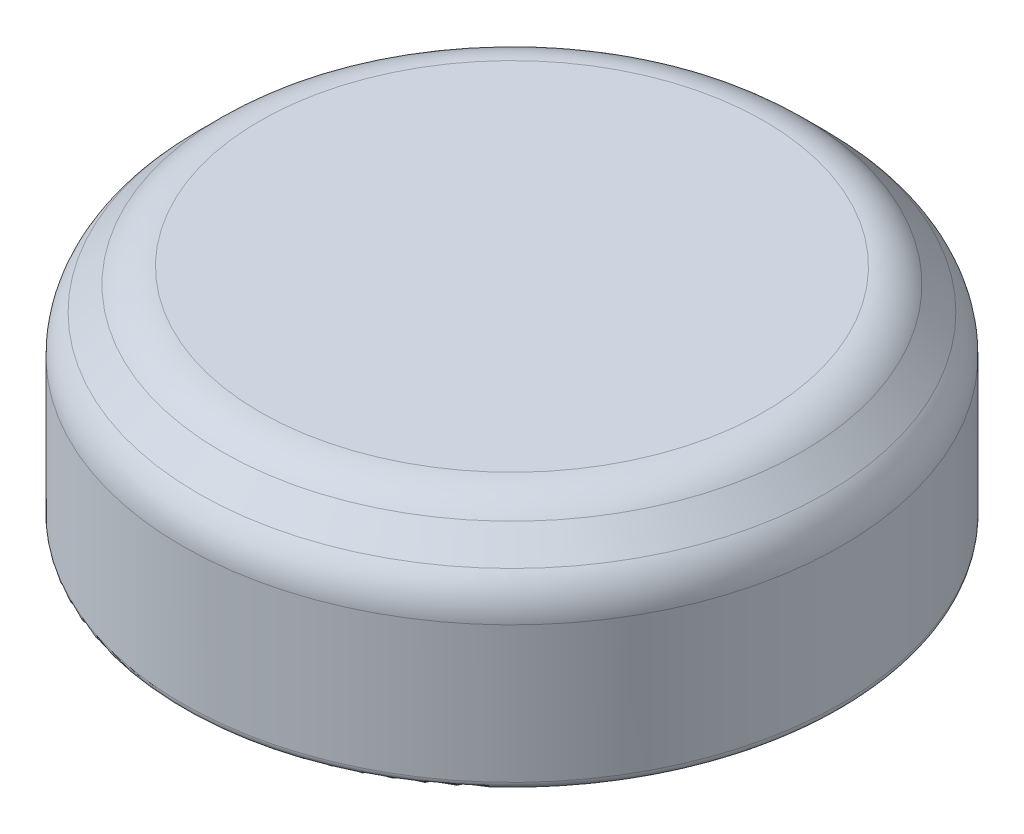
ISO-10303-21;
HEADER;
FILE_DESCRIPTION(('STEP AP214'),'2;1');
FILE_NAME('part.step','',(''),(''),'','','');
FILE_SCHEMA(('AUTOMOTIVE_DESIGN { 1 0 10303 214 1 1 1 1 }'));
ENDSEC;
DATA;
#1=APPLICATION_CONTEXT('core data for automotive mechanical design processes');
#2=APPLICATION_PROTOCOL_DEFINITION('international standard','automotive_design',2000,#1);
#3=PRODUCT_CONTEXT('',#1,'mechanical');
#4=PRODUCT('Part','Part','',(#3));
#5=PRODUCT_RELATED_PRODUCT_CATEGORY('part','',(#4));
#6=PRODUCT_DEFINITION_FORMATION('','',#4);
#7=PRODUCT_DEFINITION_CONTEXT('part definition',#1,'design');
#8=PRODUCT_DEFINITION('design','',#6,#7);
#9=PRODUCT_DEFINITION_SHAPE('','',#8);
#10=(LENGTH_UNIT() NAMED_UNIT(*) SI_UNIT(.MILLI.,.METRE.));
#11=(NAMED_UNIT(*) PLANE_ANGLE_UNIT() SI_UNIT($,.RADIAN.));
#12=(NAMED_UNIT(*) SI_UNIT($,.STERADIAN.) SOLID_ANGLE_UNIT());
#13=UNCERTAINTY_MEASURE_WITH_UNIT(LENGTH_MEASURE(1.E-05),#10,'distance_accuracy_value','');
#14=(GEOMETRIC_REPRESENTATION_CONTEXT(3) GLOBAL_UNCERTAINTY_ASSIGNED_CONTEXT((#13)) GLOBAL_UNIT_ASSIGNED_CONTEXT((#10,
#11,#12)) REPRESENTATION_CONTEXT('',''));
#15=CARTESIAN_POINT('',(0.,0.,0.));
#16=DIRECTION('',(0.,0.,1.));
#17=DIRECTION('',(1.,0.,0.));
#18=AXIS2_PLACEMENT_3D('',#15,#16,#17);
#19=CARTESIAN_POINT('',(0.,9.525,0.));
#20=DIRECTION('',(0.,-1.,0.));
#21=DIRECTION('',(0.,0.,-1.));
#22=AXIS2_PLACEMENT_3D('',#19,#20,#21);
#23=CYLINDRICAL_SURFACE('',#22,15.6591);
#24=CARTESIAN_POINT('',(0.,6.86173853094341,0.));
#25=DIRECTION('',(0.,1.,0.));
#26=DIRECTION('',(0.,0.,1.));
#27=AXIS2_PLACEMENT_3D('',#24,#25,#26);
#28=CIRCLE('',#27,15.6591);
#29=CARTESIAN_POINT('',(0.,6.86173853094341,15.6591));
#30=VERTEX_POINT('',#29);
#31=EDGE_CURVE('E377',#30,#30,#28,.F.);
#32=ORIENTED_EDGE('',*,*,#31,.T.);
#33=EDGE_LOOP('',(#32));
#34=FACE_BOUND('',#33,.T.);
#35=DIRECTION('',(0.,-1.,0.));
#36=VECTOR('',#35,1.);
#37=CARTESIAN_POINT('',(-2.54,9.525,-15.4517252373319));
#38=LINE('',#37,#36);
#39=CARTESIAN_POINT('',(-2.54,3.048,-15.4517252373319));
#40=VERTEX_POINT('',#39);
#41=CARTESIAN_POINT('',(-2.54,0.381000000000003,-15.4517252373319));
#42=VERTEX_POINT('',#41);
#43=EDGE_CURVE('E287',#40,#42,#38,.T.);
#44=ORIENTED_EDGE('',*,*,#43,.T.);
#45=CARTESIAN_POINT('',(0.,0.380999999999999,0.));
#46=DIRECTION('',(0.,1.,0.));
#47=DIRECTION('',(0.,0.,1.));
#48=AXIS2_PLACEMENT_3D('',#45,#46,#47);
#49=CIRCLE('',#48,15.6591);
#50=CARTESIAN_POINT('',(2.54,0.381000000000003,-15.4517252373319));
#51=VERTEX_POINT('',#50);
#52=EDGE_CURVE('E306',#42,#51,#49,.T.);
#53=ORIENTED_EDGE('',*,*,#52,.T.);
#54=DIRECTION('',(0.,-1.,0.));
#55=VECTOR('',#54,1.);
#56=CARTESIAN_POINT('',(2.54,9.525,-15.4517252373319));
#57=LINE('',#56,#55);
#58=CARTESIAN_POINT('',(2.54,3.048,-15.4517252373319));
#59=VERTEX_POINT('',#58);
#60=EDGE_CURVE('E276',#51,#59,#57,.F.);
#61=ORIENTED_EDGE('',*,*,#60,.T.);
#62=CARTESIAN_POINT('',(0.,3.048,0.));
#63=DIRECTION('',(0.,1.,0.));
#64=DIRECTION('',(0.,0.,1.));
#65=AXIS2_PLACEMENT_3D('',#62,#63,#64);
#66=CIRCLE('',#65,15.6591);
#67=EDGE_CURVE('E284',#59,#40,#66,.T.);
#68=ORIENTED_EDGE('',*,*,#67,.T.);
#69=EDGE_LOOP('',(#44,#53,#61,#68));
#70=FACE_BOUND('',#69,.T.);
#71=ADVANCED_FACE('F43',(#34,#70),#23,.T.);
#72=CARTESIAN_POINT('',(0.,10.541,0.));
#73=DIRECTION('',(0.,1.,0.));
#74=DIRECTION('',(0.,0.,1.));
#75=AXIS2_PLACEMENT_3D('',#72,#73,#74);
#76=PLANE('',#75);
#77=CARTESIAN_POINT('',(0.,10.541,0.));
#78=DIRECTION('',(0.,1.,0.));
#79=DIRECTION('',(0.,0.,1.));
#80=AXIS2_PLACEMENT_3D('',#77,#78,#79);
#81=CIRCLE('',#80,11.9798385309434);
#82=CARTESIAN_POINT('',(0.,10.541,11.9798385309434));
#83=VERTEX_POINT('',#82);
#84=EDGE_CURVE('E51',#83,#83,#81,.T.);
#85=ORIENTED_EDGE('',*,*,#84,.T.);
#86=EDGE_LOOP('',(#85));
#87=FACE_BOUND('',#86,.T.);
#88=ADVANCED_FACE('F385',(#87),#76,.T.);
#89=CARTESIAN_POINT('',(0.,0.,0.));
#90=DIRECTION('',(0.,1.,0.));
#91=DIRECTION('',(0.,0.,1.));
#92=AXIS2_PLACEMENT_3D('',#89,#90,#91);
#93=PLANE('',#92);
#94=DIRECTION('',(0.,0.,1.));
#95=VECTOR('',#94,1.);
#96=CARTESIAN_POINT('',(2.54,0.,-25.4));
#97=LINE('',#96,#95);
#98=CARTESIAN_POINT('',(2.54,0.,-15.0654817251225));
#99=VERTEX_POINT('',#98);
#100=CARTESIAN_POINT('',(2.54,0.,-14.421122619616));
#101=VERTEX_POINT('',#100);
#102=EDGE_CURVE('E280',#99,#101,#97,.T.);
#103=ORIENTED_EDGE('',*,*,#102,.F.);
#104=CARTESIAN_POINT('',(0.,0.,0.));
#105=DIRECTION('',(0.,1.,0.));
#106=DIRECTION('',(0.,0.,1.));
#107=AXIS2_PLACEMENT_3D('',#104,#105,#106);
#108=CIRCLE('',#107,15.2781);
#109=CARTESIAN_POINT('',(-2.54,0.,-15.0654817251225));
#110=VERTEX_POINT('',#109);
#111=EDGE_CURVE('E317',#99,#110,#108,.F.);
#112=ORIENTED_EDGE('',*,*,#111,.T.);
#113=DIRECTION('',(0.,0.,1.));
#114=VECTOR('',#113,1.);
#115=CARTESIAN_POINT('',(-2.54,0.,-25.4));
#116=LINE('',#115,#114);
#117=CARTESIAN_POINT('',(-2.54,0.,-14.421122619616));
#118=VERTEX_POINT('',#117);
#119=EDGE_CURVE('E268',#110,#118,#116,.T.);
#120=ORIENTED_EDGE('',*,*,#119,.T.);
#121=CARTESIAN_POINT('',(0.,0.,0.));
#122=DIRECTION('',(0.,1.,0.));
#123=DIRECTION('',(0.,0.,1.));
#124=AXIS2_PLACEMENT_3D('',#121,#122,#123);
#125=CIRCLE('',#124,14.6431);
#126=EDGE_CURVE('E290',#118,#101,#125,.T.);
#127=ORIENTED_EDGE('',*,*,#126,.T.);
#128=EDGE_LOOP('',(#103,#112,#120,#127));
#129=FACE_BOUND('',#128,.T.);
#130=ADVANCED_FACE('F401',(#129),#93,.F.);
#131=CARTESIAN_POINT('',(0.,10.2434204896855,0.));
#132=DIRECTION('',(0.,-1.,0.));
#133=DIRECTION('',(0.,0.,-1.));
#134=AXIS2_PLACEMENT_3D('',#131,#132,#133);
#135=CONICAL_SURFACE('',#134,13.3295204896855,0.785398163397448);
#136=CARTESIAN_POINT('',(0.,9.79705122421383,0.));
#137=DIRECTION('',(0.,1.,0.));
#138=DIRECTION('',(0.,0.,1.));
#139=AXIS2_PLACEMENT_3D('',#136,#137,#138);
#140=CIRCLE('',#139,13.7758897551572);
#141=CARTESIAN_POINT('',(0.,9.79705122421383,13.7758897551572));
#142=VERTEX_POINT('',#141);
#143=EDGE_CURVE('E13',#142,#142,#140,.F.);
#144=ORIENTED_EDGE('',*,*,#143,.T.);
#145=EDGE_LOOP('',(#144));
#146=FACE_BOUND('',#145,.T.);
#147=CARTESIAN_POINT('',(0.,8.65778975515723,0.));
#148=DIRECTION('',(0.,-1.,0.));
#149=DIRECTION('',(0.,0.,-1.));
#150=AXIS2_PLACEMENT_3D('',#147,#148,#149);
#151=CIRCLE('',#150,14.9151512242138);
#152=CARTESIAN_POINT('',(0.,8.65778975515723,-14.9151512242138));
#153=VERTEX_POINT('',#152);
#154=EDGE_CURVE('E380',#153,#153,#151,.F.);
#155=ORIENTED_EDGE('',*,*,#154,.T.);
#156=EDGE_LOOP('',(#155));
#157=FACE_BOUND('',#156,.T.);
#158=ADVANCED_FACE('F406',(#146,#157),#135,.T.);
#159=CARTESIAN_POINT('',(0.,9.525,0.));
#160=DIRECTION('',(0.,-1.,0.));
#161=DIRECTION('',(0.,0.,-1.));
#162=AXIS2_PLACEMENT_3D('',#159,#160,#161);
#163=CYLINDRICAL_SURFACE('',#162,14.6431);
#164=CARTESIAN_POINT('',(0.,4.064,0.));
#165=DIRECTION('',(0.,-1.,0.));
#166=DIRECTION('',(0.,0.,-1.));
#167=AXIS2_PLACEMENT_3D('',#164,#165,#166);
#168=CIRCLE('',#167,14.6431);
#169=CARTESIAN_POINT('',(14.0112451841449,4.064,-4.25504242044378));
#170=VERTEX_POINT('',#169);
#171=CARTESIAN_POINT('',(14.3885328877532,4.064,-2.71854721276747));
#172=VERTEX_POINT('',#171);
#173=EDGE_CURVE('E375',#170,#172,#168,.T.);
#174=ORIENTED_EDGE('',*,*,#173,.F.);
#175=CARTESIAN_POINT('',(0.,19.1585044123121,0.));
#176=DIRECTION('',(-0.238140052837793,0.0523359562429443,-0.969819706398333));
#177=DIRECTION('',(-0.0124803913275749,-0.998629534754574,-0.0508260971172682));
#178=AXIS2_PLACEMENT_3D('',#175,#176,#177);
#179=ELLIPSE('',#178,279.7904357002,14.6431);
#180=CARTESIAN_POINT('',(14.0354158288751,5.6642,-4.17462335074222));
#181=VERTEX_POINT('',#180);
#182=EDGE_CURVE('E373',#181,#170,#179,.T.);
#183=ORIENTED_EDGE('',*,*,#182,.F.);
#184=CARTESIAN_POINT('',(0.,5.6642,0.));
#185=DIRECTION('',(0.,1.,0.));
#186=DIRECTION('',(0.,0.,1.));
#187=AXIS2_PLACEMENT_3D('',#184,#185,#186);
#188=CIRCLE('',#187,14.6431);
#189=CARTESIAN_POINT('',(14.3727064734993,5.6642,-2.80101521535152));
#190=VERTEX_POINT('',#189);
#191=EDGE_CURVE('E371',#190,#181,#188,.T.);
#192=ORIENTED_EDGE('',*,*,#191,.F.);
#193=CARTESIAN_POINT('',(0.,19.1585044123126,0.));
#194=DIRECTION('',(0.238140052837793,0.0523359562429433,0.969819706398333));
#195=DIRECTION('',(0.0124803913275747,-0.998629534754574,0.0508260971172671));
#196=AXIS2_PLACEMENT_3D('',#193,#194,#195);
#197=ELLIPSE('',#196,279.790435700206,14.6431);
#198=EDGE_CURVE('E189',#172,#190,#197,.T.);
#199=ORIENTED_EDGE('',*,*,#198,.F.);
#200=EDGE_LOOP('',(#174,#183,#192,#199));
#201=FACE_BOUND('',#200,.T.);
#202=CARTESIAN_POINT('',(0.,4.064,0.));
#203=DIRECTION('',(0.,-1.,0.));
#204=DIRECTION('',(1.,0.,0.));
#205=AXIS2_PLACEMENT_3D('',#202,#203,#204);
#206=CIRCLE('',#205,14.6431);
#207=CARTESIAN_POINT('',(4.25504242044363,4.064,14.011245184145));
#208=VERTEX_POINT('',#207);
#209=CARTESIAN_POINT('',(2.71854721276732,4.064,14.3885328877532));
#210=VERTEX_POINT('',#209);
#211=EDGE_CURVE('E368',#208,#210,#206,.T.);
#212=ORIENTED_EDGE('',*,*,#211,.F.);
#213=CARTESIAN_POINT('',(0.,19.1585044123121,0.));
#214=DIRECTION('',(0.969819706398336,0.0523359562429443,-0.238140052837783));
#215=DIRECTION('',(0.0508260971172683,-0.998629534754574,-0.0124803913275744));
#216=AXIS2_PLACEMENT_3D('',#213,#214,#215);
#217=ELLIPSE('',#216,279.7904357002,14.6431);
#218=CARTESIAN_POINT('',(4.17462335074207,5.6642,14.0354158288751));
#219=VERTEX_POINT('',#218);
#220=EDGE_CURVE('E366',#219,#208,#217,.T.);
#221=ORIENTED_EDGE('',*,*,#220,.F.);
#222=CARTESIAN_POINT('',(0.,5.6642,0.));
#223=DIRECTION('',(0.,1.,0.));
#224=DIRECTION('',(-1.,0.,0.));
#225=AXIS2_PLACEMENT_3D('',#222,#223,#224);
#226=CIRCLE('',#225,14.6431);
#227=CARTESIAN_POINT('',(2.80101521535137,5.6642,14.3727064734994));
#228=VERTEX_POINT('',#227);
#229=EDGE_CURVE('E364',#228,#219,#226,.T.);
#230=ORIENTED_EDGE('',*,*,#229,.F.);
#231=CARTESIAN_POINT('',(0.,19.1585044123126,0.));
#232=DIRECTION('',(-0.969819706398336,0.0523359562429433,0.238140052837783));
#233=DIRECTION('',(-0.0508260971172673,-0.998629534754574,0.0124803913275742));
#234=AXIS2_PLACEMENT_3D('',#231,#232,#233);
#235=ELLIPSE('',#234,279.790435700206,14.6431);
#236=EDGE_CURVE('E362',#210,#228,#235,.T.);
#237=ORIENTED_EDGE('',*,*,#236,.F.);
#238=EDGE_LOOP('',(#212,#221,#230,#237));
#239=FACE_BOUND('',#238,.T.);
#240=CARTESIAN_POINT('',(0.,4.064,0.));
#241=DIRECTION('',(0.,-1.,0.));
#242=DIRECTION('',(0.,0.,-1.));
#243=AXIS2_PLACEMENT_3D('',#240,#241,#242);
#244=CIRCLE('',#243,14.6431);
#245=CARTESIAN_POINT('',(-14.0112451841449,4.064,4.25504242044368));
#246=VERTEX_POINT('',#245);
#247=CARTESIAN_POINT('',(-14.3885328877532,4.064,2.71854721276737));
#248=VERTEX_POINT('',#247);
#249=EDGE_CURVE('E359',#246,#248,#244,.T.);
#250=ORIENTED_EDGE('',*,*,#249,.F.);
#251=CARTESIAN_POINT('',(0.,19.1585044123121,0.));
#252=DIRECTION('',(0.238140052837786,0.0523359562429443,0.969819706398335));
#253=DIRECTION('',(0.0124803913275746,-0.998629534754574,0.0508260971172682));
#254=AXIS2_PLACEMENT_3D('',#251,#252,#253);
#255=ELLIPSE('',#254,279.7904357002,14.6431);
#256=CARTESIAN_POINT('',(-14.0354158288751,5.6642,4.17462335074212));
#257=VERTEX_POINT('',#256);
#258=EDGE_CURVE('E357',#257,#246,#255,.T.);
#259=ORIENTED_EDGE('',*,*,#258,.F.);
#260=CARTESIAN_POINT('',(0.,5.6642,0.));
#261=DIRECTION('',(0.,1.,0.));
#262=DIRECTION('',(0.,0.,1.));
#263=AXIS2_PLACEMENT_3D('',#260,#261,#262);
#264=CIRCLE('',#263,14.6431);
#265=CARTESIAN_POINT('',(-14.3727064734993,5.6642,2.80101521535142));
#266=VERTEX_POINT('',#265);
#267=EDGE_CURVE('E355',#266,#257,#264,.T.);
#268=ORIENTED_EDGE('',*,*,#267,.F.);
#269=CARTESIAN_POINT('',(0.,19.1585044123126,0.));
#270=DIRECTION('',(-0.238140052837786,0.0523359562429433,-0.969819706398335));
#271=DIRECTION('',(-0.0124803913275743,-0.998629534754574,-0.0508260971172672));
#272=AXIS2_PLACEMENT_3D('',#269,#270,#271);
#273=ELLIPSE('',#272,279.790435700206,14.6431);
#274=EDGE_CURVE('E353',#248,#266,#273,.T.);
#275=ORIENTED_EDGE('',*,*,#274,.F.);
#276=EDGE_LOOP('',(#250,#259,#268,#275));
#277=FACE_BOUND('',#276,.T.);
#278=CARTESIAN_POINT('',(0.,4.064,0.));
#279=DIRECTION('',(0.,-1.,0.));
#280=DIRECTION('',(1.,0.,0.));
#281=AXIS2_PLACEMENT_3D('',#278,#279,#280);
#282=CIRCLE('',#281,14.6431);
#283=CARTESIAN_POINT('',(-4.25504242044363,4.064,-14.011245184145));
#284=VERTEX_POINT('',#283);
#285=CARTESIAN_POINT('',(-2.71854721276732,4.064,-14.3885328877532));
#286=VERTEX_POINT('',#285);
#287=EDGE_CURVE('E350',#284,#286,#282,.T.);
#288=ORIENTED_EDGE('',*,*,#287,.F.);
#289=CARTESIAN_POINT('',(0.,19.1585044123121,0.));
#290=DIRECTION('',(-0.969819706398336,0.0523359562429443,0.238140052837783));
#291=DIRECTION('',(-0.0508260971172683,-0.998629534754574,0.0124803913275744));
#292=AXIS2_PLACEMENT_3D('',#289,#290,#291);
#293=ELLIPSE('',#292,279.7904357002,14.6431);
#294=CARTESIAN_POINT('',(-4.17462335074207,5.6642,-14.0354158288751));
#295=VERTEX_POINT('',#294);
#296=EDGE_CURVE('E348',#295,#284,#293,.T.);
#297=ORIENTED_EDGE('',*,*,#296,.F.);
#298=CARTESIAN_POINT('',(0.,5.6642,0.));
#299=DIRECTION('',(0.,1.,0.));
#300=DIRECTION('',(-1.,0.,0.));
#301=AXIS2_PLACEMENT_3D('',#298,#299,#300);
#302=CIRCLE('',#301,14.6431);
#303=CARTESIAN_POINT('',(-2.80101521535137,5.6642,-14.3727064734994));
#304=VERTEX_POINT('',#303);
#305=EDGE_CURVE('E346',#304,#295,#302,.T.);
#306=ORIENTED_EDGE('',*,*,#305,.F.);
#307=CARTESIAN_POINT('',(0.,19.1585044123126,0.));
#308=DIRECTION('',(0.969819706398336,0.0523359562429433,-0.238140052837783));
#309=DIRECTION('',(0.0508260971172673,-0.998629534754574,-0.0124803913275742));
#310=AXIS2_PLACEMENT_3D('',#307,#308,#309);
#311=ELLIPSE('',#310,279.790435700206,14.6431);
#312=EDGE_CURVE('E344',#286,#304,#311,.T.);
#313=ORIENTED_EDGE('',*,*,#312,.F.);
#314=EDGE_LOOP('',(#288,#297,#306,#313));
#315=FACE_BOUND('',#314,.T.);
#316=DIRECTION('',(0.,-1.,0.));
#317=VECTOR('',#316,1.);
#318=CARTESIAN_POINT('',(-2.54,9.525,-14.421122619616));
#319=LINE('',#318,#317);
#320=CARTESIAN_POINT('',(-2.54,3.048,-14.421122619616));
#321=VERTEX_POINT('',#320);
#322=EDGE_CURVE('E303',#321,#118,#319,.T.);
#323=ORIENTED_EDGE('',*,*,#322,.F.);
#324=CARTESIAN_POINT('',(0.,3.048,0.));
#325=DIRECTION('',(0.,1.,0.));
#326=DIRECTION('',(0.,0.,1.));
#327=AXIS2_PLACEMENT_3D('',#324,#325,#326);
#328=CIRCLE('',#327,14.6431);
#329=CARTESIAN_POINT('',(2.54,3.048,-14.421122619616));
#330=VERTEX_POINT('',#329);
#331=EDGE_CURVE('E301',#330,#321,#328,.T.);
#332=ORIENTED_EDGE('',*,*,#331,.F.);
#333=DIRECTION('',(0.,-1.,0.));
#334=VECTOR('',#333,1.);
#335=CARTESIAN_POINT('',(2.54,9.525,-14.421122619616));
#336=LINE('',#335,#334);
#337=EDGE_CURVE('E299',#101,#330,#336,.F.);
#338=ORIENTED_EDGE('',*,*,#337,.F.);
#339=ORIENTED_EDGE('',*,*,#126,.F.);
#340=EDGE_LOOP('',(#323,#332,#338,#339));
#341=FACE_BOUND('',#340,.T.);
#342=CARTESIAN_POINT('',(0.,7.493,0.));
#343=DIRECTION('',(0.,1.,0.));
#344=DIRECTION('',(0.,0.,1.));
#345=AXIS2_PLACEMENT_3D('',#342,#343,#344);
#346=CIRCLE('',#345,14.6431);
#347=CARTESIAN_POINT('',(0.,7.493,14.6431));
#348=VERTEX_POINT('',#347);
#349=EDGE_CURVE('E296',#348,#348,#346,.F.);
#350=ORIENTED_EDGE('',*,*,#349,.F.);
#351=EDGE_LOOP('',(#350));
#352=FACE_BOUND('',#351,.T.);
#353=ADVANCED_FACE('F408',(#201,#239,#277,#315,#341,#352),#163,.F.);
#354=CARTESIAN_POINT('',(0.,9.525,0.));
#355=DIRECTION('',(0.,1.,0.));
#356=DIRECTION('',(0.,0.,1.));
#357=AXIS2_PLACEMENT_3D('',#354,#355,#356);
#358=PLANE('',#357);
#359=CARTESIAN_POINT('',(0.,9.525,0.));
#360=DIRECTION('',(0.,1.,0.));
#361=DIRECTION('',(0.,0.,1.));
#362=AXIS2_PLACEMENT_3D('',#359,#360,#361);
#363=CIRCLE('',#362,12.6111);
#364=CARTESIAN_POINT('',(0.,9.525,12.6111));
#365=VERTEX_POINT('',#364);
#366=EDGE_CURVE('E293',#365,#365,#363,.T.);
#367=ORIENTED_EDGE('',*,*,#366,.F.);
#368=EDGE_LOOP('',(#367));
#369=FACE_BOUND('',#368,.T.);
#370=ADVANCED_FACE('F336',(#369),#358,.F.);
#371=CARTESIAN_POINT('',(0.,9.525,0.));
#372=DIRECTION('',(0.,-1.,0.));
#373=DIRECTION('',(0.,0.,-1.));
#374=AXIS2_PLACEMENT_3D('',#371,#372,#373);
#375=CONICAL_SURFACE('',#374,12.6111,0.785398163397448);
#376=ORIENTED_EDGE('',*,*,#349,.T.);
#377=EDGE_LOOP('',(#376));
#378=FACE_BOUND('',#377,.T.);
#379=ORIENTED_EDGE('',*,*,#366,.T.);
#380=EDGE_LOOP('',(#379));
#381=FACE_BOUND('',#380,.T.);
#382=ADVANCED_FACE('F334',(#378,#381),#375,.F.);
#383=CARTESIAN_POINT('',(-2.54,0.,-25.4));
#384=DIRECTION('',(-1.,0.,0.));
#385=DIRECTION('',(0.,-1.,0.));
#386=AXIS2_PLACEMENT_3D('',#383,#384,#385);
#387=PLANE('',#386);
#388=ORIENTED_EDGE('',*,*,#119,.F.);
#389=CARTESIAN_POINT('',(-2.54,0.,-15.0654817251225));
#390=CARTESIAN_POINT('',(-2.54,-1.72254223182717E-05,-15.0874335175876));
#391=CARTESIAN_POINT('',(-2.54,0.0018437625846541,-15.1093818382942));
#392=CARTESIAN_POINT('',(-2.54,0.00919882073363489,-15.1526533495357));
#393=CARTESIAN_POINT('',(-2.54,0.0146915700603816,-15.173976764396));
#394=CARTESIAN_POINT('',(-2.54,0.0291915571867698,-15.2154102263428));
#395=CARTESIAN_POINT('',(-2.54,0.0382010164721961,-15.2355194971716));
#396=CARTESIAN_POINT('',(-2.54,0.0594868787289586,-15.2739209705587));
#397=CARTESIAN_POINT('',(-2.54,0.0717623099228582,-15.2922137113988));
#398=CARTESIAN_POINT('',(-2.54,0.0991551906744806,-15.3263300304729));
#399=CARTESIAN_POINT('',(-2.54,0.114253082413144,-15.342169305227));
#400=CARTESIAN_POINT('',(-2.54,0.14692910445411,-15.371051020832));
#401=CARTESIAN_POINT('',(-2.54,0.164507650988167,-15.3840929913928));
#402=CARTESIAN_POINT('',(-2.54,0.201398605825967,-15.4068256371085));
#403=CARTESIAN_POINT('',(-2.54,0.220685867512696,-15.4165571730314));
#404=CARTESIAN_POINT('',(-2.54,0.260628764366469,-15.4325935498973));
#405=CARTESIAN_POINT('',(-2.54,0.281283319454961,-15.4389010602127));
#406=CARTESIAN_POINT('',(-2.54,0.315241896564793,-15.4461673332976));
#407=CARTESIAN_POINT('',(-2.54,0.328315796659931,-15.4482503498726));
#408=CARTESIAN_POINT('',(-2.54,0.354591129350472,-15.4510289629907));
#409=CARTESIAN_POINT('',(-2.54,0.367792351298366,-15.4517265521848));
#410=CARTESIAN_POINT('',(-2.54,0.380999999999796,-15.4517252373329));
#411=B_SPLINE_CURVE_WITH_KNOTS('',3,(#389,#390,#391,#392,#393,#394,#395,#396,#397,#398,#399,
#400,#401,#402,#403,#404,#405,#406,#407,#408,#409,#410),.UNSPECIFIED.,.F.,.F.,(4,2,2,2,2,2,2,2,
2,2,4),(0.,0.0657720126096425,0.131520118105964,0.197309823698158,0.263079975665277,
0.328410227796389,0.39375145482387,0.458254127073134,0.522706440521001,0.562355500632073,
0.601947492340685),.UNSPECIFIED.);
#412=EDGE_CURVE('E338',#110,#42,#411,.T.);
#413=ORIENTED_EDGE('',*,*,#412,.T.);
#414=ORIENTED_EDGE('',*,*,#43,.F.);
#415=DIRECTION('',(0.,0.,1.));
#416=VECTOR('',#415,1.);
#417=CARTESIAN_POINT('',(-2.54,3.048,-25.4));
#418=LINE('',#417,#416);
#419=EDGE_CURVE('E273',#40,#321,#418,.T.);
#420=ORIENTED_EDGE('',*,*,#419,.T.);
#421=ORIENTED_EDGE('',*,*,#322,.T.);
#422=EDGE_LOOP('',(#388,#413,#414,#420,#421));
#423=FACE_BOUND('',#422,.T.);
#424=ADVANCED_FACE('F330',(#423),#387,.F.);
#425=CARTESIAN_POINT('',(-2.54,3.048,-25.4));
#426=DIRECTION('',(0.,1.,0.));
#427=DIRECTION('',(0.,0.,1.));
#428=AXIS2_PLACEMENT_3D('',#425,#426,#427);
#429=PLANE('',#428);
#430=DIRECTION('',(0.,0.,1.));
#431=VECTOR('',#430,1.);
#432=CARTESIAN_POINT('',(2.54,3.048,-25.4));
#433=LINE('',#432,#431);
#434=EDGE_CURVE('E277',#59,#330,#433,.T.);
#435=ORIENTED_EDGE('',*,*,#434,.T.);
#436=ORIENTED_EDGE('',*,*,#331,.T.);
#437=ORIENTED_EDGE('',*,*,#419,.F.);
#438=ORIENTED_EDGE('',*,*,#67,.F.);
#439=EDGE_LOOP('',(#435,#436,#437,#438));
#440=FACE_BOUND('',#439,.T.);
#441=ADVANCED_FACE('F327',(#440),#429,.F.);
#442=CARTESIAN_POINT('',(2.54,0.,-25.4));
#443=DIRECTION('',(1.,0.,0.));
#444=DIRECTION('',(0.,1.,0.));
#445=AXIS2_PLACEMENT_3D('',#442,#443,#444);
#446=PLANE('',#445);
#447=ORIENTED_EDGE('',*,*,#60,.F.);
#448=CARTESIAN_POINT('',(2.54,0.380999999999999,-15.4517252373319));
#449=CARTESIAN_POINT('',(2.54,0.359772490891302,-15.4517445966209));
#450=CARTESIAN_POINT('',(2.54,0.338552065598666,-15.4499285919333));
#451=CARTESIAN_POINT('',(2.54,0.296738615147838,-15.4427706701231));
#452=CARTESIAN_POINT('',(2.54,0.276144893476583,-15.4374328289169));
#453=CARTESIAN_POINT('',(2.54,0.236139244993673,-15.4233729551959));
#454=CARTESIAN_POINT('',(2.54,0.216727738558608,-15.4146497269274));
#455=CARTESIAN_POINT('',(2.54,0.179634954507945,-15.3940883898612));
#456=CARTESIAN_POINT('',(2.54,0.161953551564201,-15.3822505069177));
#457=CARTESIAN_POINT('',(2.54,0.128705585184497,-15.3557305831975));
#458=CARTESIAN_POINT('',(2.54,0.113151656785204,-15.3410327083369));
#459=CARTESIAN_POINT('',(2.54,0.0846921536658848,-15.3092604523183));
#460=CARTESIAN_POINT('',(2.54,0.071787150003215,-15.2921855600495));
#461=CARTESIAN_POINT('',(2.54,0.0488197071337158,-15.2559162402967));
#462=CARTESIAN_POINT('',(2.54,0.03879556369564,-15.236697588268));
#463=CARTESIAN_POINT('',(2.54,0.0220747214168526,-15.1968671141949));
#464=CARTESIAN_POINT('',(2.54,0.0153767301925492,-15.1762558368001));
#465=CARTESIAN_POINT('',(2.54,0.00696106685301918,-15.1405387495994));
#466=CARTESIAN_POINT('',(2.54,0.00435210173695012,-15.1256364320892));
#467=CARTESIAN_POINT('',(2.54,0.000871658125724737,-15.0956517892088));
#468=CARTESIAN_POINT('',(2.54,-2.28805720762536E-06,-15.0805697502337));
#469=CARTESIAN_POINT('',(2.54,0.,-15.0654817251225));
#470=B_SPLINE_CURVE_WITH_KNOTS('',3,(#448,#449,#450,#451,#452,#453,#454,#455,#456,#457,#458,
#459,#460,#461,#462,#463,#464,#465,#466,#467,#468,#469),.UNSPECIFIED.,.F.,.F.,(4,2,2,2,2,2,2,2,
2,2,4),(0.,0.0635945245725841,0.127115578283885,0.190659088740896,0.2541979927132,
0.318099232539739,0.382014233812814,0.446743248535656,0.511447092943298,0.556738675021806,
0.60196579337516),.UNSPECIFIED.);
#471=EDGE_CURVE('E309',#51,#99,#470,.T.);
#472=ORIENTED_EDGE('',*,*,#471,.T.);
#473=ORIENTED_EDGE('',*,*,#102,.T.);
#474=ORIENTED_EDGE('',*,*,#337,.T.);
#475=ORIENTED_EDGE('',*,*,#434,.F.);
#476=EDGE_LOOP('',(#447,#472,#473,#474,#475));
#477=FACE_BOUND('',#476,.T.);
#478=ADVANCED_FACE('F322',(#477),#446,.F.);
#479=CARTESIAN_POINT('',(0.,0.380999999999999,0.));
#480=DIRECTION('',(0.,1.,0.));
#481=DIRECTION('',(0.,0.,1.));
#482=AXIS2_PLACEMENT_3D('',#479,#480,#481);
#483=TOROIDAL_SURFACE('',#482,15.2781,0.381);
#484=ORIENTED_EDGE('',*,*,#412,.F.);
#485=ORIENTED_EDGE('',*,*,#111,.F.);
#486=ORIENTED_EDGE('',*,*,#471,.F.);
#487=ORIENTED_EDGE('',*,*,#52,.F.);
#488=EDGE_LOOP('',(#484,#485,#486,#487));
#489=FACE_BOUND('',#488,.T.);
#490=ADVANCED_FACE('F319',(#489),#483,.T.);
#491=CARTESIAN_POINT('',(-3.42223795645592,4.064,-13.9369827570171));
#492=DIRECTION('',(0.,-1.,0.));
#493=DIRECTION('',(0.23846686338624,0.,0.971150634591117));
#494=AXIS2_PLACEMENT_3D('',#491,#492,#493);
#495=PLANE('',#494);
#496=ORIENTED_EDGE('',*,*,#287,.T.);
#497=DIRECTION('',(0.238466863386239,0.,0.971150634591117));
#498=VECTOR('',#497,1.);
#499=CARTESIAN_POINT('',(-2.63279064846273,4.064,-14.0392913174061));
#500=LINE('',#499,#498);
#501=CARTESIAN_POINT('',(-2.85387327750811,4.064,-14.9396450707355));
#502=VERTEX_POINT('',#501);
#503=EDGE_CURVE('E264',#502,#286,#500,.T.);
#504=ORIENTED_EDGE('',*,*,#503,.F.);
#505=DIRECTION('',(0.971150634591117,0.,-0.23846686338624));
#506=VECTOR('',#505,1.);
#507=CARTESIAN_POINT('',(-3.62212088134626,4.064,-14.7510012189314));
#508=LINE('',#507,#506);
#509=CARTESIAN_POINT('',(-4.39036848518442,4.064,-14.5623573671273));
#510=VERTEX_POINT('',#509);
#511=EDGE_CURVE('E269',#510,#502,#508,.T.);
#512=ORIENTED_EDGE('',*,*,#511,.F.);
#513=DIRECTION('',(-0.238466863386239,0.,-0.971150634591117));
#514=VECTOR('',#513,1.);
#515=CARTESIAN_POINT('',(-4.16928585613904,4.064,-13.6620036137979));
#516=LINE('',#515,#514);
#517=EDGE_CURVE('E266',#284,#510,#516,.T.);
#518=ORIENTED_EDGE('',*,*,#517,.F.);
#519=EDGE_LOOP('',(#496,#504,#512,#518));
#520=FACE_BOUND('',#519,.T.);
#521=ADVANCED_FACE('F473',(#520),#495,.F.);
#522=CARTESIAN_POINT('',(-4.08784231999624,5.6642,-13.6820021432899));
#523=DIRECTION('',(-0.969819706398336,0.0523359562429443,0.238140052837783));
#524=DIRECTION('',(-0.0508260971172683,-0.998629534754574,0.0124803913275744));
#525=AXIS2_PLACEMENT_3D('',#522,#523,#524);
#526=PLANE('',#525);
#527=ORIENTED_EDGE('',*,*,#296,.T.);
#528=ORIENTED_EDGE('',*,*,#517,.T.);
#529=DIRECTION('',(-0.0508260971172683,-0.998629534754574,0.0124803913275744));
#530=VECTOR('',#529,1.);
#531=CARTESIAN_POINT('',(-4.30704375676945,5.70116160575151,-14.5828178249799));
#532=LINE('',#531,#530);
#533=CARTESIAN_POINT('',(-4.30892494904162,5.6642,-14.5823558966193));
#534=VERTEX_POINT('',#533);
#535=EDGE_CURVE('E261',#534,#510,#532,.T.);
#536=ORIENTED_EDGE('',*,*,#535,.F.);
#537=DIRECTION('',(0.23846686338624,0.,0.971150634591117));
#538=VECTOR('',#537,1.);
#539=CARTESIAN_POINT('',(-4.08784231999624,5.6642,-13.6820021432899));
#540=LINE('',#539,#538);
#541=EDGE_CURVE('E249',#534,#295,#540,.T.);
#542=ORIENTED_EDGE('',*,*,#541,.T.);
#543=EDGE_LOOP('',(#527,#528,#536,#542));
#544=FACE_BOUND('',#543,.T.);
#545=ADVANCED_FACE('F479',(#544),#526,.F.);
#546=CARTESIAN_POINT('',(-3.62212088134626,5.6642,-14.7510012189314));
#547=DIRECTION('',(-0.23846686338624,0.,-0.971150634591117));
#548=DIRECTION('',(0.,-1.,0.));
#549=AXIS2_PLACEMENT_3D('',#546,#547,#548);
#550=PLANE('',#549);
#551=ORIENTED_EDGE('',*,*,#535,.T.);
#552=ORIENTED_EDGE('',*,*,#511,.T.);
#553=DIRECTION('',(0.0508260971172672,-0.998629534754574,-0.0124803913275742));
#554=VECTOR('',#553,1.);
#555=CARTESIAN_POINT('',(-2.93531681365091,5.6642,-14.9196465412435));
#556=LINE('',#555,#554);
#557=CARTESIAN_POINT('',(-2.93531681365091,5.6642,-14.9196465412435));
#558=VERTEX_POINT('',#557);
#559=EDGE_CURVE('E256',#558,#502,#556,.T.);
#560=ORIENTED_EDGE('',*,*,#559,.F.);
#561=DIRECTION('',(-0.971150634591117,0.,0.23846686338624));
#562=VECTOR('',#561,1.);
#563=CARTESIAN_POINT('',(-3.62212088134626,5.6642,-14.7510012189314));
#564=LINE('',#563,#562);
#565=EDGE_CURVE('E257',#558,#534,#564,.T.);
#566=ORIENTED_EDGE('',*,*,#565,.T.);
#567=EDGE_LOOP('',(#551,#552,#560,#566));
#568=FACE_BOUND('',#567,.T.);
#569=ADVANCED_FACE('F486',(#568),#550,.F.);
#570=CARTESIAN_POINT('',(-3.40103825230088,5.6642,-13.850647465602));
#571=DIRECTION('',(0.,1.,0.));
#572=DIRECTION('',(-0.971150634591117,0.,0.23846686338624));
#573=AXIS2_PLACEMENT_3D('',#570,#571,#572);
#574=PLANE('',#573);
#575=ORIENTED_EDGE('',*,*,#305,.T.);
#576=ORIENTED_EDGE('',*,*,#541,.F.);
#577=ORIENTED_EDGE('',*,*,#565,.F.);
#578=DIRECTION('',(-0.23846686338624,0.,-0.971150634591117));
#579=VECTOR('',#578,1.);
#580=CARTESIAN_POINT('',(-2.71423418460553,5.6642,-14.0192927879141));
#581=LINE('',#580,#579);
#582=EDGE_CURVE('E254',#304,#558,#581,.T.);
#583=ORIENTED_EDGE('',*,*,#582,.F.);
#584=EDGE_LOOP('',(#575,#576,#577,#583));
#585=FACE_BOUND('',#584,.T.);
#586=ADVANCED_FACE('F494',(#585),#574,.F.);
#587=CARTESIAN_POINT('',(-2.71423418460553,5.6642,-14.0192927879141));
#588=DIRECTION('',(0.969819706398336,0.0523359562429433,-0.238140052837783));
#589=DIRECTION('',(-0.0508260971172673,0.998629534754574,0.0124803913275742));
#590=AXIS2_PLACEMENT_3D('',#587,#588,#589);
#591=PLANE('',#590);
#592=ORIENTED_EDGE('',*,*,#312,.T.);
#593=ORIENTED_EDGE('',*,*,#582,.T.);
#594=ORIENTED_EDGE('',*,*,#559,.T.);
#595=ORIENTED_EDGE('',*,*,#503,.T.);
#596=EDGE_LOOP('',(#592,#593,#594,#595));
#597=FACE_BOUND('',#596,.T.);
#598=ADVANCED_FACE('F502',(#597),#591,.F.);
#599=CARTESIAN_POINT('',(-13.9369827570171,4.064,3.42223795645597));
#600=DIRECTION('',(0.,-1.,0.));
#601=DIRECTION('',(0.971150634591116,0.,-0.238466863386243));
#602=AXIS2_PLACEMENT_3D('',#599,#600,#601);
#603=PLANE('',#602);
#604=ORIENTED_EDGE('',*,*,#249,.T.);
#605=DIRECTION('',(0.971150634591116,0.,-0.238466863386243));
#606=VECTOR('',#605,1.);
#607=CARTESIAN_POINT('',(-14.0392913174061,4.064,2.63279064846278));
#608=LINE('',#607,#606);
#609=CARTESIAN_POINT('',(-14.9396450707355,4.064,2.85387327750816));
#610=VERTEX_POINT('',#609);
#611=EDGE_CURVE('E245',#610,#248,#608,.T.);
#612=ORIENTED_EDGE('',*,*,#611,.F.);
#613=DIRECTION('',(-0.238466863386243,0.,-0.971150634591116));
#614=VECTOR('',#613,1.);
#615=CARTESIAN_POINT('',(-14.7510012189314,4.064,3.62212088134632));
#616=LINE('',#615,#614);
#617=CARTESIAN_POINT('',(-14.5623573671273,4.064,4.39036848518447));
#618=VERTEX_POINT('',#617);
#619=EDGE_CURVE('E250',#618,#610,#616,.T.);
#620=ORIENTED_EDGE('',*,*,#619,.F.);
#621=DIRECTION('',(-0.971150634591116,0.,0.238466863386243));
#622=VECTOR('',#621,1.);
#623=CARTESIAN_POINT('',(-13.6620036137978,4.064,4.16928585613908));
#624=LINE('',#623,#622);
#625=EDGE_CURVE('E247',#246,#618,#624,.T.);
#626=ORIENTED_EDGE('',*,*,#625,.F.);
#627=EDGE_LOOP('',(#604,#612,#620,#626));
#628=FACE_BOUND('',#627,.T.);
#629=ADVANCED_FACE('F510',(#628),#603,.F.);
#630=CARTESIAN_POINT('',(-13.6820021432898,5.6642,4.08784231999628));
#631=DIRECTION('',(0.238140052837786,0.0523359562429443,0.969819706398335));
#632=DIRECTION('',(0.0124803913275746,-0.998629534754574,0.0508260971172682));
#633=AXIS2_PLACEMENT_3D('',#630,#631,#632);
#634=PLANE('',#633);
#635=ORIENTED_EDGE('',*,*,#258,.T.);
#636=ORIENTED_EDGE('',*,*,#625,.T.);
#637=DIRECTION('',(0.0124803913275745,-0.998629534754574,0.0508260971172683));
#638=VECTOR('',#637,1.);
#639=CARTESIAN_POINT('',(-14.5828178249799,5.70116160575151,4.3070437567695));
#640=LINE('',#639,#638);
#641=CARTESIAN_POINT('',(-14.5823558966193,5.6642,4.30892494904167));
#642=VERTEX_POINT('',#641);
#643=EDGE_CURVE('E242',#642,#618,#640,.T.);
#644=ORIENTED_EDGE('',*,*,#643,.F.);
#645=DIRECTION('',(0.971150634591116,0.,-0.238466863386243));
#646=VECTOR('',#645,1.);
#647=CARTESIAN_POINT('',(-13.6820021432898,5.6642,4.08784231999628));
#648=LINE('',#647,#646);
#649=EDGE_CURVE('E230',#642,#257,#648,.T.);
#650=ORIENTED_EDGE('',*,*,#649,.T.);
#651=EDGE_LOOP('',(#635,#636,#644,#650));
#652=FACE_BOUND('',#651,.T.);
#653=ADVANCED_FACE('F518',(#652),#634,.F.);
#654=CARTESIAN_POINT('',(-14.7510012189314,5.6642,3.62212088134631));
#655=DIRECTION('',(-0.971150634591116,0.,0.238466863386243));
#656=DIRECTION('',(0.,-1.,0.));
#657=AXIS2_PLACEMENT_3D('',#654,#655,#656);
#658=PLANE('',#657);
#659=ORIENTED_EDGE('',*,*,#643,.T.);
#660=ORIENTED_EDGE('',*,*,#619,.T.);
#661=DIRECTION('',(-0.0124803913275744,-0.998629534754574,-0.0508260971172672));
#662=VECTOR('',#661,1.);
#663=CARTESIAN_POINT('',(-14.9196465412435,5.6642,2.93531681365096));
#664=LINE('',#663,#662);
#665=CARTESIAN_POINT('',(-14.9196465412435,5.6642,2.93531681365096));
#666=VERTEX_POINT('',#665);
#667=EDGE_CURVE('E237',#666,#610,#664,.T.);
#668=ORIENTED_EDGE('',*,*,#667,.F.);
#669=DIRECTION('',(0.238466863386243,0.,0.971150634591116));
#670=VECTOR('',#669,1.);
#671=CARTESIAN_POINT('',(-14.7510012189314,5.6642,3.62212088134631));
#672=LINE('',#671,#670);
#673=EDGE_CURVE('E238',#666,#642,#672,.T.);
#674=ORIENTED_EDGE('',*,*,#673,.T.);
#675=EDGE_LOOP('',(#659,#660,#668,#674));
#676=FACE_BOUND('',#675,.T.);
#677=ADVANCED_FACE('F526',(#676),#658,.F.);
#678=CARTESIAN_POINT('',(-13.850647465602,5.6642,3.40103825230093));
#679=DIRECTION('',(0.,1.,0.));
#680=DIRECTION('',(0.238466863386243,0.,0.971150634591116));
#681=AXIS2_PLACEMENT_3D('',#678,#679,#680);
#682=PLANE('',#681);
#683=ORIENTED_EDGE('',*,*,#267,.T.);
#684=ORIENTED_EDGE('',*,*,#649,.F.);
#685=ORIENTED_EDGE('',*,*,#673,.F.);
#686=DIRECTION('',(-0.971150634591116,0.,0.238466863386243));
#687=VECTOR('',#686,1.);
#688=CARTESIAN_POINT('',(-14.0192927879141,5.6642,2.71423418460558));
#689=LINE('',#688,#687);
#690=EDGE_CURVE('E235',#266,#666,#689,.T.);
#691=ORIENTED_EDGE('',*,*,#690,.F.);
#692=EDGE_LOOP('',(#683,#684,#685,#691));
#693=FACE_BOUND('',#692,.T.);
#694=ADVANCED_FACE('F534',(#693),#682,.F.);
#695=CARTESIAN_POINT('',(-14.0192927879141,5.6642,2.71423418460558));
#696=DIRECTION('',(-0.238140052837786,0.0523359562429433,-0.969819706398335));
#697=DIRECTION('',(0.0124803913275743,0.998629534754574,0.0508260971172672));
#698=AXIS2_PLACEMENT_3D('',#695,#696,#697);
#699=PLANE('',#698);
#700=ORIENTED_EDGE('',*,*,#274,.T.);
#701=ORIENTED_EDGE('',*,*,#690,.T.);
#702=ORIENTED_EDGE('',*,*,#667,.T.);
#703=ORIENTED_EDGE('',*,*,#611,.T.);
#704=EDGE_LOOP('',(#700,#701,#702,#703));
#705=FACE_BOUND('',#704,.T.);
#706=ADVANCED_FACE('F542',(#705),#699,.F.);
#707=CARTESIAN_POINT('',(3.42223795645592,4.064,13.9369827570171));
#708=DIRECTION('',(0.,-1.,0.));
#709=DIRECTION('',(-0.23846686338624,0.,-0.971150634591117));
#710=AXIS2_PLACEMENT_3D('',#707,#708,#709);
#711=PLANE('',#710);
#712=ORIENTED_EDGE('',*,*,#211,.T.);
#713=DIRECTION('',(-0.238466863386239,0.,-0.971150634591117));
#714=VECTOR('',#713,1.);
#715=CARTESIAN_POINT('',(2.63279064846273,4.064,14.0392913174061));
#716=LINE('',#715,#714);
#717=CARTESIAN_POINT('',(2.85387327750811,4.064,14.9396450707355));
#718=VERTEX_POINT('',#717);
#719=EDGE_CURVE('E66',#718,#210,#716,.T.);
#720=ORIENTED_EDGE('',*,*,#719,.F.);
#721=DIRECTION('',(-0.971150634591117,0.,0.23846686338624));
#722=VECTOR('',#721,1.);
#723=CARTESIAN_POINT('',(3.62212088134626,4.064,14.7510012189314));
#724=LINE('',#723,#722);
#725=CARTESIAN_POINT('',(4.39036848518442,4.064,14.5623573671273));
#726=VERTEX_POINT('',#725);
#727=EDGE_CURVE('E231',#726,#718,#724,.T.);
#728=ORIENTED_EDGE('',*,*,#727,.F.);
#729=DIRECTION('',(0.238466863386239,0.,0.971150634591117));
#730=VECTOR('',#729,1.);
#731=CARTESIAN_POINT('',(4.16928585613904,4.064,13.6620036137979));
#732=LINE('',#731,#730);
#733=EDGE_CURVE('E228',#208,#726,#732,.T.);
#734=ORIENTED_EDGE('',*,*,#733,.F.);
#735=EDGE_LOOP('',(#712,#720,#728,#734));
#736=FACE_BOUND('',#735,.T.);
#737=ADVANCED_FACE('F550',(#736),#711,.F.);
#738=CARTESIAN_POINT('',(4.08784231999624,5.6642,13.6820021432899));
#739=DIRECTION('',(0.969819706398336,0.0523359562429443,-0.238140052837783));
#740=DIRECTION('',(0.0508260971172683,-0.998629534754574,-0.0124803913275744));
#741=AXIS2_PLACEMENT_3D('',#738,#739,#740);
#742=PLANE('',#741);
#743=ORIENTED_EDGE('',*,*,#220,.T.);
#744=ORIENTED_EDGE('',*,*,#733,.T.);
#745=DIRECTION('',(0.0508260971172683,-0.998629534754574,-0.0124803913275744));
#746=VECTOR('',#745,1.);
#747=CARTESIAN_POINT('',(4.30704375676945,5.70116160575151,14.5828178249799));
#748=LINE('',#747,#746);
#749=CARTESIAN_POINT('',(4.30892494904162,5.6642,14.5823558966193));
#750=VERTEX_POINT('',#749);
#751=EDGE_CURVE('E224',#750,#726,#748,.T.);
#752=ORIENTED_EDGE('',*,*,#751,.F.);
#753=DIRECTION('',(-0.23846686338624,0.,-0.971150634591117));
#754=VECTOR('',#753,1.);
#755=CARTESIAN_POINT('',(4.08784231999624,5.6642,13.6820021432899));
#756=LINE('',#755,#754);
#757=EDGE_CURVE('E214',#750,#219,#756,.T.);
#758=ORIENTED_EDGE('',*,*,#757,.T.);
#759=EDGE_LOOP('',(#743,#744,#752,#758));
#760=FACE_BOUND('',#759,.T.);
#761=ADVANCED_FACE('F558',(#760),#742,.F.);
#762=CARTESIAN_POINT('',(3.62212088134626,5.6642,14.7510012189314));
#763=DIRECTION('',(0.23846686338624,0.,0.971150634591117));
#764=DIRECTION('',(0.,-1.,0.));
#765=AXIS2_PLACEMENT_3D('',#762,#763,#764);
#766=PLANE('',#765);
#767=ORIENTED_EDGE('',*,*,#751,.T.);
#768=ORIENTED_EDGE('',*,*,#727,.T.);
#769=DIRECTION('',(-0.0508260971172672,-0.998629534754574,0.0124803913275742));
#770=VECTOR('',#769,1.);
#771=CARTESIAN_POINT('',(2.93531681365091,5.6642,14.9196465412435));
#772=LINE('',#771,#770);
#773=CARTESIAN_POINT('',(2.93531681365091,5.6642,14.9196465412435));
#774=VERTEX_POINT('',#773);
#775=EDGE_CURVE('E219',#774,#718,#772,.T.);
#776=ORIENTED_EDGE('',*,*,#775,.F.);
#777=DIRECTION('',(0.971150634591117,0.,-0.23846686338624));
#778=VECTOR('',#777,1.);
#779=CARTESIAN_POINT('',(3.62212088134626,5.6642,14.7510012189314));
#780=LINE('',#779,#778);
#781=EDGE_CURVE('E220',#774,#750,#780,.T.);
#782=ORIENTED_EDGE('',*,*,#781,.T.);
#783=EDGE_LOOP('',(#767,#768,#776,#782));
#784=FACE_BOUND('',#783,.T.);
#785=ADVANCED_FACE('F566',(#784),#766,.F.);
#786=CARTESIAN_POINT('',(3.40103825230088,5.6642,13.850647465602));
#787=DIRECTION('',(0.,1.,0.));
#788=DIRECTION('',(0.971150634591117,0.,-0.23846686338624));
#789=AXIS2_PLACEMENT_3D('',#786,#787,#788);
#790=PLANE('',#789);
#791=ORIENTED_EDGE('',*,*,#229,.T.);
#792=ORIENTED_EDGE('',*,*,#757,.F.);
#793=ORIENTED_EDGE('',*,*,#781,.F.);
#794=DIRECTION('',(0.23846686338624,0.,0.971150634591117));
#795=VECTOR('',#794,1.);
#796=CARTESIAN_POINT('',(2.71423418460553,5.6642,14.0192927879141));
#797=LINE('',#796,#795);
#798=EDGE_CURVE('E217',#228,#774,#797,.T.);
#799=ORIENTED_EDGE('',*,*,#798,.F.);
#800=EDGE_LOOP('',(#791,#792,#793,#799));
#801=FACE_BOUND('',#800,.T.);
#802=ADVANCED_FACE('F574',(#801),#790,.F.);
#803=CARTESIAN_POINT('',(2.71423418460553,5.6642,14.0192927879141));
#804=DIRECTION('',(-0.969819706398336,0.0523359562429433,0.238140052837783));
#805=DIRECTION('',(0.0508260971172673,0.998629534754574,-0.0124803913275742));
#806=AXIS2_PLACEMENT_3D('',#803,#804,#805);
#807=PLANE('',#806);
#808=ORIENTED_EDGE('',*,*,#236,.T.);
#809=ORIENTED_EDGE('',*,*,#798,.T.);
#810=ORIENTED_EDGE('',*,*,#775,.T.);
#811=ORIENTED_EDGE('',*,*,#719,.T.);
#812=EDGE_LOOP('',(#808,#809,#810,#811));
#813=FACE_BOUND('',#812,.T.);
#814=ADVANCED_FACE('F582',(#813),#807,.F.);
#815=CARTESIAN_POINT('',(13.9369827570171,4.064,-3.42223795645606));
#816=DIRECTION('',(0.,-1.,0.));
#817=DIRECTION('',(-0.971150634591114,0.,0.23846686338625));
#818=AXIS2_PLACEMENT_3D('',#815,#816,#817);
#819=PLANE('',#818);
#820=ORIENTED_EDGE('',*,*,#173,.T.);
#821=DIRECTION('',(-0.971150634591114,0.,0.23846686338625));
#822=VECTOR('',#821,1.);
#823=CARTESIAN_POINT('',(14.0392913174061,4.064,-2.63279064846287));
#824=LINE('',#823,#822);
#825=CARTESIAN_POINT('',(14.9396450707355,4.064,-2.85387327750827));
#826=VERTEX_POINT('',#825);
#827=EDGE_CURVE('E58',#826,#172,#824,.T.);
#828=ORIENTED_EDGE('',*,*,#827,.F.);
#829=DIRECTION('',(0.23846686338625,0.,0.971150634591114));
#830=VECTOR('',#829,1.);
#831=CARTESIAN_POINT('',(14.7510012189314,4.064,-3.62212088134642));
#832=LINE('',#831,#830);
#833=CARTESIAN_POINT('',(14.5623573671272,4.064,-4.39036848518457));
#834=VERTEX_POINT('',#833);
#835=EDGE_CURVE('E201',#834,#826,#832,.T.);
#836=ORIENTED_EDGE('',*,*,#835,.F.);
#837=DIRECTION('',(0.971150634591114,0.,-0.23846686338625));
#838=VECTOR('',#837,1.);
#839=CARTESIAN_POINT('',(13.6620036137978,4.064,-4.16928585613918));
#840=LINE('',#839,#838);
#841=EDGE_CURVE('E212',#170,#834,#840,.T.);
#842=ORIENTED_EDGE('',*,*,#841,.F.);
#843=EDGE_LOOP('',(#820,#828,#836,#842));
#844=FACE_BOUND('',#843,.T.);
#845=ADVANCED_FACE('F590',(#844),#819,.F.);
#846=CARTESIAN_POINT('',(13.6820021432898,5.6642,-4.08784231999638));
#847=DIRECTION('',(-0.238140052837793,0.0523359562429443,-0.969819706398333));
#848=DIRECTION('',(-0.0124803913275749,-0.998629534754574,-0.0508260971172682));
#849=AXIS2_PLACEMENT_3D('',#846,#847,#848);
#850=PLANE('',#849);
#851=ORIENTED_EDGE('',*,*,#182,.T.);
#852=ORIENTED_EDGE('',*,*,#841,.T.);
#853=DIRECTION('',(-0.0124803913275749,-0.998629534754574,-0.0508260971172682));
#854=VECTOR('',#853,1.);
#855=CARTESIAN_POINT('',(14.5828178249799,5.70116160575151,-4.30704375676961));
#856=LINE('',#855,#854);
#857=CARTESIAN_POINT('',(14.5823558966192,5.6642,-4.30892494904177));
#858=VERTEX_POINT('',#857);
#859=EDGE_CURVE('E202',#858,#834,#856,.T.);
#860=ORIENTED_EDGE('',*,*,#859,.F.);
#861=DIRECTION('',(-0.971150634591114,0.,0.23846686338625));
#862=VECTOR('',#861,1.);
#863=CARTESIAN_POINT('',(13.6820021432898,5.6642,-4.08784231999638));
#864=LINE('',#863,#862);
#865=EDGE_CURVE('E207',#858,#181,#864,.T.);
#866=ORIENTED_EDGE('',*,*,#865,.T.);
#867=EDGE_LOOP('',(#851,#852,#860,#866));
#868=FACE_BOUND('',#867,.T.);
#869=ADVANCED_FACE('F597',(#868),#850,.F.);
#870=CARTESIAN_POINT('',(14.7510012189314,5.6642,-3.62212088134642));
#871=DIRECTION('',(0.971150634591114,0.,-0.23846686338625));
#872=DIRECTION('',(0.,-1.,0.));
#873=AXIS2_PLACEMENT_3D('',#870,#871,#872);
#874=PLANE('',#873);
#875=ORIENTED_EDGE('',*,*,#859,.T.);
#876=ORIENTED_EDGE('',*,*,#835,.T.);
#877=DIRECTION('',(0.0124803913275747,-0.998629534754574,0.0508260971172671));
#878=VECTOR('',#877,1.);
#879=CARTESIAN_POINT('',(14.9196465412435,5.6642,-2.93531681365107));
#880=LINE('',#879,#878);
#881=CARTESIAN_POINT('',(14.9196465412435,5.6642,-2.93531681365107));
#882=VERTEX_POINT('',#881);
#883=EDGE_CURVE('E187',#882,#826,#880,.T.);
#884=ORIENTED_EDGE('',*,*,#883,.F.);
#885=DIRECTION('',(-0.23846686338625,0.,-0.971150634591114));
#886=VECTOR('',#885,1.);
#887=CARTESIAN_POINT('',(14.7510012189314,5.6642,-3.62212088134642));
#888=LINE('',#887,#886);
#889=EDGE_CURVE('E193',#882,#858,#888,.T.);
#890=ORIENTED_EDGE('',*,*,#889,.T.);
#891=EDGE_LOOP('',(#875,#876,#884,#890));
#892=FACE_BOUND('',#891,.T.);
#893=ADVANCED_FACE('F198',(#892),#874,.F.);
#894=CARTESIAN_POINT('',(13.8506474656019,5.6642,-3.40103825230103));
#895=DIRECTION('',(0.,1.,0.));
#896=DIRECTION('',(-0.23846686338625,0.,-0.971150634591114));
#897=AXIS2_PLACEMENT_3D('',#894,#895,#896);
#898=PLANE('',#897);
#899=ORIENTED_EDGE('',*,*,#191,.T.);
#900=ORIENTED_EDGE('',*,*,#865,.F.);
#901=ORIENTED_EDGE('',*,*,#889,.F.);
#902=DIRECTION('',(0.971150634591114,0.,-0.23846686338625));
#903=VECTOR('',#902,1.);
#904=CARTESIAN_POINT('',(14.019292787914,5.6642,-2.71423418460567));
#905=LINE('',#904,#903);
#906=EDGE_CURVE('E184',#190,#882,#905,.T.);
#907=ORIENTED_EDGE('',*,*,#906,.F.);
#908=EDGE_LOOP('',(#899,#900,#901,#907));
#909=FACE_BOUND('',#908,.T.);
#910=ADVANCED_FACE('F205',(#909),#898,.F.);
#911=CARTESIAN_POINT('',(14.019292787914,5.6642,-2.71423418460567));
#912=DIRECTION('',(0.238140052837793,0.0523359562429433,0.969819706398333));
#913=DIRECTION('',(-0.0124803913275747,0.998629534754574,-0.0508260971172671));
#914=AXIS2_PLACEMENT_3D('',#911,#912,#913);
#915=PLANE('',#914);
#916=ORIENTED_EDGE('',*,*,#198,.T.);
#917=ORIENTED_EDGE('',*,*,#906,.T.);
#918=ORIENTED_EDGE('',*,*,#883,.T.);
#919=ORIENTED_EDGE('',*,*,#827,.T.);
#920=EDGE_LOOP('',(#916,#917,#918,#919));
#921=FACE_BOUND('',#920,.T.);
#922=ADVANCED_FACE('F186',(#921),#915,.F.);
#923=CARTESIAN_POINT('',(0.,6.86173853094341,0.));
#924=DIRECTION('',(0.,1.,0.));
#925=DIRECTION('',(0.,0.,1.));
#926=AXIS2_PLACEMENT_3D('',#923,#924,#925);
#927=TOROIDAL_SURFACE('',#926,13.1191,2.54);
#928=ORIENTED_EDGE('',*,*,#154,.F.);
#929=EDGE_LOOP('',(#928));
#930=FACE_BOUND('',#929,.T.);
#931=ORIENTED_EDGE('',*,*,#31,.F.);
#932=EDGE_LOOP('',(#931));
#933=FACE_BOUND('',#932,.T.);
#934=ADVANCED_FACE('F388',(#930,#933),#927,.T.);
#935=CARTESIAN_POINT('',(0.,8.001,0.));
#936=DIRECTION('',(0.,1.,0.));
#937=DIRECTION('',(0.,0.,1.));
#938=AXIS2_PLACEMENT_3D('',#935,#936,#937);
#939=TOROIDAL_SURFACE('',#938,11.9798385309434,2.54);
#940=ORIENTED_EDGE('',*,*,#143,.F.);
#941=EDGE_LOOP('',(#940));
#942=FACE_BOUND('',#941,.T.);
#943=ORIENTED_EDGE('',*,*,#84,.F.);
#944=EDGE_LOOP('',(#943));
#945=FACE_BOUND('',#944,.T.);
#946=ADVANCED_FACE('F45',(#942,#945),#939,.T.);
#947=CLOSED_SHELL('',(#71,#88,#130,#158,#353,#370,#382,#424,#441,#478,#490,#521,#545,#569,#586,
#598,#629,#653,#677,#694,#706,#737,#761,#785,#802,#814,#845,#869,#893,#910,#922,#934,#946));
#948=MANIFOLD_SOLID_BREP('B2',#947);
#949=ADVANCED_BREP_SHAPE_REPRESENTATION('',(#18,#948),#14);
#950=SHAPE_DEFINITION_REPRESENTATION(#9,#949);
ENDSEC;
END-ISO-10303-21;
